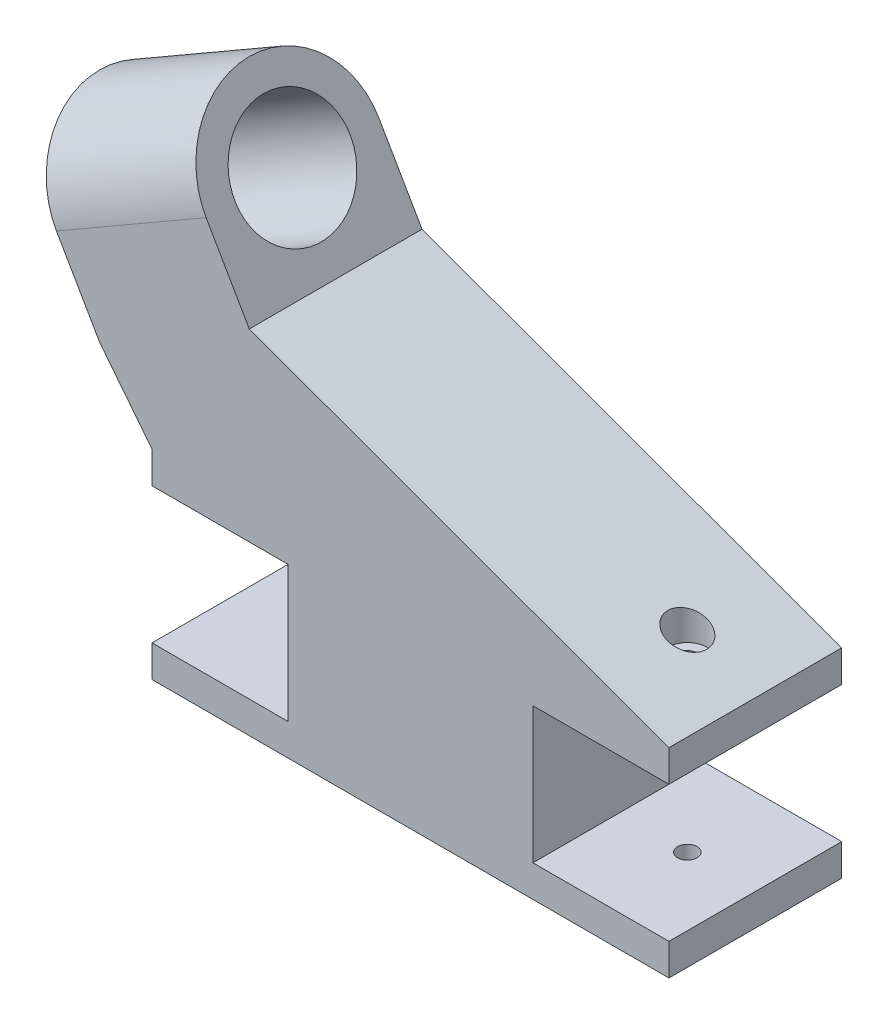
ISO-10303-21;
HEADER;
FILE_DESCRIPTION(('STEP AP214'),'2;1');
FILE_NAME('part.step','',(''),(''),'','','');
FILE_SCHEMA(('AUTOMOTIVE_DESIGN { 1 0 10303 214 1 1 1 1 }'));
ENDSEC;
DATA;
#1=APPLICATION_CONTEXT('core data for automotive mechanical design processes');
#2=APPLICATION_PROTOCOL_DEFINITION('international standard','automotive_design',2000,#1);
#3=PRODUCT_CONTEXT('',#1,'mechanical');
#4=PRODUCT('Part','Part','',(#3));
#5=PRODUCT_RELATED_PRODUCT_CATEGORY('part','',(#4));
#6=PRODUCT_DEFINITION_FORMATION('','',#4);
#7=PRODUCT_DEFINITION_CONTEXT('part definition',#1,'design');
#8=PRODUCT_DEFINITION('design','',#6,#7);
#9=PRODUCT_DEFINITION_SHAPE('','',#8);
#10=(LENGTH_UNIT() NAMED_UNIT(*) SI_UNIT(.MILLI.,.METRE.));
#11=(NAMED_UNIT(*) PLANE_ANGLE_UNIT() SI_UNIT($,.RADIAN.));
#12=(NAMED_UNIT(*) SI_UNIT($,.STERADIAN.) SOLID_ANGLE_UNIT());
#13=UNCERTAINTY_MEASURE_WITH_UNIT(LENGTH_MEASURE(1.E-05),#10,'distance_accuracy_value','');
#14=(GEOMETRIC_REPRESENTATION_CONTEXT(3) GLOBAL_UNCERTAINTY_ASSIGNED_CONTEXT((#13)) GLOBAL_UNIT_ASSIGNED_CONTEXT((#10,
#11,#12)) REPRESENTATION_CONTEXT('',''));
#15=CARTESIAN_POINT('',(0.,0.,0.));
#16=DIRECTION('',(0.,0.,1.));
#17=DIRECTION('',(1.,0.,0.));
#18=AXIS2_PLACEMENT_3D('',#15,#16,#17);
#19=CARTESIAN_POINT('',(-87.5933518262805,47.6249999999999,38.1));
#20=DIRECTION('',(0.866025403784438,0.500000000000001,0.));
#21=DIRECTION('',(-0.500000000000001,0.866025403784438,0.));
#22=AXIS2_PLACEMENT_3D('',#19,#20,#21);
#23=PLANE('',#22);
#24=CARTESIAN_POINT('',(-78.0683518262805,31.1272160579064,19.05));
#25=DIRECTION('',(0.866025403784438,0.500000000000001,0.));
#26=DIRECTION('',(-0.500000000000001,0.866025403784438,0.));
#27=AXIS2_PLACEMENT_3D('',#24,#25,#26);
#28=CIRCLE('',#27,12.7);
#29=CARTESIAN_POINT('',(-84.4183518262805,42.1257386859688,19.05));
#30=VERTEX_POINT('',#29);
#31=EDGE_CURVE('E354',#30,#30,#28,.T.);
#32=ORIENTED_EDGE('',*,*,#31,.T.);
#33=EDGE_LOOP('',(#32));
#34=FACE_BOUND('',#33,.T.);
#35=CARTESIAN_POINT('',(-78.0683518262805,31.1272160579064,19.05));
#36=DIRECTION('',(0.866025403784438,0.500000000000001,0.));
#37=DIRECTION('',(-0.500000000000001,0.866025403784438,0.));
#38=AXIS2_PLACEMENT_3D('',#35,#36,#37);
#39=CIRCLE('',#38,19.05);
#40=CARTESIAN_POINT('',(-78.0683518262805,31.1272160579064,38.1));
#41=VERTEX_POINT('',#40);
#42=CARTESIAN_POINT('',(-78.0683518262805,31.1272160579064,0.));
#43=VERTEX_POINT('',#42);
#44=EDGE_CURVE('E62',#41,#43,#39,.F.);
#45=ORIENTED_EDGE('',*,*,#44,.T.);
#46=DIRECTION('',(0.500000000000001,-0.866025403784438,0.));
#47=VECTOR('',#46,1.);
#48=CARTESIAN_POINT('',(-87.5933518262805,47.6249999999999,0.));
#49=LINE('',#48,#47);
#50=CARTESIAN_POINT('',(-68.5433518262805,14.6294321158129,0.));
#51=VERTEX_POINT('',#50);
#52=EDGE_CURVE('E204',#43,#51,#49,.T.);
#53=ORIENTED_EDGE('',*,*,#52,.T.);
#54=DIRECTION('',(0.,0.,-1.));
#55=VECTOR('',#54,1.);
#56=CARTESIAN_POINT('',(-68.5433518262805,14.6294321158129,38.1));
#57=LINE('',#56,#55);
#58=CARTESIAN_POINT('',(-68.5433518262805,14.6294321158129,38.1));
#59=VERTEX_POINT('',#58);
#60=EDGE_CURVE('E290',#59,#51,#57,.T.);
#61=ORIENTED_EDGE('',*,*,#60,.F.);
#62=DIRECTION('',(0.500000000000001,-0.866025403784438,0.));
#63=VECTOR('',#62,1.);
#64=CARTESIAN_POINT('',(-87.5933518262805,47.6249999999999,38.1));
#65=LINE('',#64,#63);
#66=EDGE_CURVE('E131',#41,#59,#65,.T.);
#67=ORIENTED_EDGE('',*,*,#66,.F.);
#68=EDGE_LOOP('',(#45,#53,#61,#67));
#69=FACE_BOUND('',#68,.T.);
#70=ADVANCED_FACE('F47',(#34,#69),#23,.F.);
#71=CARTESIAN_POINT('',(-54.5977839420934,66.675,38.1));
#72=DIRECTION('',(0.866025403784438,0.500000000000001,0.));
#73=DIRECTION('',(-0.500000000000001,0.866025403784438,0.));
#74=AXIS2_PLACEMENT_3D('',#71,#72,#73);
#75=PLANE('',#74);
#76=CARTESIAN_POINT('',(-45.0727839420934,50.1772160579064,19.05));
#77=DIRECTION('',(0.866025403784438,0.500000000000001,0.));
#78=DIRECTION('',(-0.500000000000001,0.866025403784438,0.));
#79=AXIS2_PLACEMENT_3D('',#76,#77,#78);
#80=CIRCLE('',#79,12.7);
#81=CARTESIAN_POINT('',(-51.4227839420934,61.1757386859688,19.05));
#82=VERTEX_POINT('',#81);
#83=EDGE_CURVE('E412',#82,#82,#80,.T.);
#84=ORIENTED_EDGE('',*,*,#83,.F.);
#85=EDGE_LOOP('',(#84));
#86=FACE_BOUND('',#85,.T.);
#87=DIRECTION('',(0.500000000000001,-0.866025403784438,0.));
#88=VECTOR('',#87,1.);
#89=CARTESIAN_POINT('',(-54.5977839420934,66.675,0.));
#90=LINE('',#89,#88);
#91=CARTESIAN_POINT('',(-45.0727839420934,50.1772160579064,0.));
#92=VERTEX_POINT('',#91);
#93=CARTESIAN_POINT('',(-35.5477839420934,33.6794321158129,0.));
#94=VERTEX_POINT('',#93);
#95=EDGE_CURVE('E124',#92,#94,#90,.T.);
#96=ORIENTED_EDGE('',*,*,#95,.F.);
#97=CARTESIAN_POINT('',(-45.0727839420934,50.1772160579064,19.05));
#98=DIRECTION('',(0.866025403784438,0.500000000000001,0.));
#99=DIRECTION('',(-0.500000000000001,0.866025403784438,0.));
#100=AXIS2_PLACEMENT_3D('',#97,#98,#99);
#101=CIRCLE('',#100,19.05);
#102=CARTESIAN_POINT('',(-45.0727839420934,50.1772160579064,38.1));
#103=VERTEX_POINT('',#102);
#104=EDGE_CURVE('E349',#103,#92,#101,.F.);
#105=ORIENTED_EDGE('',*,*,#104,.F.);
#106=DIRECTION('',(0.500000000000001,-0.866025403784438,0.));
#107=VECTOR('',#106,1.);
#108=CARTESIAN_POINT('',(-54.5977839420934,66.675,38.1));
#109=LINE('',#108,#107);
#110=CARTESIAN_POINT('',(-35.5477839420934,33.6794321158129,38.1));
#111=VERTEX_POINT('',#110);
#112=EDGE_CURVE('E71',#103,#111,#109,.T.);
#113=ORIENTED_EDGE('',*,*,#112,.T.);
#114=DIRECTION('',(0.,0.,-1.));
#115=VECTOR('',#114,1.);
#116=CARTESIAN_POINT('',(-35.5477839420934,33.6794321158129,38.1));
#117=LINE('',#116,#115);
#118=EDGE_CURVE('E203',#111,#94,#117,.T.);
#119=ORIENTED_EDGE('',*,*,#118,.T.);
#120=EDGE_LOOP('',(#96,#105,#113,#119));
#121=FACE_BOUND('',#120,.T.);
#122=ADVANCED_FACE('F347',(#86,#121),#75,.T.);
#123=CARTESIAN_POINT('',(0.,0.,0.));
#124=DIRECTION('',(0.,0.,1.));
#125=DIRECTION('',(1.,0.,0.));
#126=AXIS2_PLACEMENT_3D('',#123,#124,#125);
#127=PLANE('',#126);
#128=DIRECTION('',(0.866025403784438,0.500000000000001,0.));
#129=VECTOR('',#128,1.);
#130=CARTESIAN_POINT('',(-117.743140586926,8.22096608690626,0.));
#131=LINE('',#130,#129);
#132=EDGE_CURVE('E11',#92,#43,#131,.F.);
#133=ORIENTED_EDGE('',*,*,#132,.F.);
#134=ORIENTED_EDGE('',*,*,#95,.T.);
#135=DIRECTION('',(0.939709610175946,-0.341973461752474,0.));
#136=VECTOR('',#135,1.);
#137=CARTESIAN_POINT('',(-35.5477839420934,33.6794321158129,0.));
#138=LINE('',#137,#136);
#139=CARTESIAN_POINT('',(56.999999919,-1.09287578986539E-13,0.));
#140=VERTEX_POINT('',#139);
#141=EDGE_CURVE('E252',#94,#140,#138,.T.);
#142=ORIENTED_EDGE('',*,*,#141,.T.);
#143=DIRECTION('',(0.,-1.,0.));
#144=VECTOR('',#143,1.);
#145=CARTESIAN_POINT('',(56.999999919,-1.09287578986539E-13,0.));
#146=LINE('',#145,#144);
#147=CARTESIAN_POINT('',(56.999999919,-6.99999997000011,0.));
#148=VERTEX_POINT('',#147);
#149=EDGE_CURVE('E249',#140,#148,#146,.T.);
#150=ORIENTED_EDGE('',*,*,#149,.T.);
#151=DIRECTION('',(-1.,0.,0.));
#152=VECTOR('',#151,1.);
#153=CARTESIAN_POINT('',(56.999999919,-6.99999997000011,0.));
#154=LINE('',#153,#152);
#155=CARTESIAN_POINT('',(26.999999975,-6.99999997000008,0.));
#156=VERTEX_POINT('',#155);
#157=EDGE_CURVE('E173',#148,#156,#154,.T.);
#158=ORIENTED_EDGE('',*,*,#157,.T.);
#159=DIRECTION('',(0.,-1.,0.));
#160=VECTOR('',#159,1.);
#161=CARTESIAN_POINT('',(26.999999975,-6.99999997000008,0.));
#162=LINE('',#161,#160);
#163=CARTESIAN_POINT('',(26.999999975,-36.9999999140001,0.));
#164=VERTEX_POINT('',#163);
#165=EDGE_CURVE('E243',#156,#164,#162,.T.);
#166=ORIENTED_EDGE('',*,*,#165,.T.);
#167=DIRECTION('',(1.,0.,0.));
#168=VECTOR('',#167,1.);
#169=CARTESIAN_POINT('',(26.999999975,-36.9999999140001,0.));
#170=LINE('',#169,#168);
#171=CARTESIAN_POINT('',(56.999999919,-36.9999999140001,0.));
#172=VERTEX_POINT('',#171);
#173=EDGE_CURVE('E239',#164,#172,#170,.T.);
#174=ORIENTED_EDGE('',*,*,#173,.T.);
#175=DIRECTION('',(0.,-1.,0.));
#176=VECTOR('',#175,1.);
#177=CARTESIAN_POINT('',(56.999999919,-36.9999999140001,0.));
#178=LINE('',#177,#176);
#179=CARTESIAN_POINT('',(56.999999919,-43.9999998840001,0.));
#180=VERTEX_POINT('',#179);
#181=EDGE_CURVE('E235',#172,#180,#178,.T.);
#182=ORIENTED_EDGE('',*,*,#181,.T.);
#183=DIRECTION('',(-1.,0.,0.));
#184=VECTOR('',#183,1.);
#185=CARTESIAN_POINT('',(56.999999919,-43.9999998840001,0.));
#186=LINE('',#185,#184);
#187=CARTESIAN_POINT('',(-56.999999919,-43.9999998840001,0.));
#188=VERTEX_POINT('',#187);
#189=EDGE_CURVE('E231',#180,#188,#186,.T.);
#190=ORIENTED_EDGE('',*,*,#189,.T.);
#191=DIRECTION('',(0.,1.,0.));
#192=VECTOR('',#191,1.);
#193=CARTESIAN_POINT('',(-56.999999919,-43.9999998840001,0.));
#194=LINE('',#193,#192);
#195=CARTESIAN_POINT('',(-56.999999919,-36.9999999140001,0.));
#196=VERTEX_POINT('',#195);
#197=EDGE_CURVE('E227',#188,#196,#194,.T.);
#198=ORIENTED_EDGE('',*,*,#197,.T.);
#199=DIRECTION('',(1.,0.,0.));
#200=VECTOR('',#199,1.);
#201=CARTESIAN_POINT('',(-56.999999919,-36.9999999140001,0.));
#202=LINE('',#201,#200);
#203=CARTESIAN_POINT('',(-26.999999975,-36.9999999140001,0.));
#204=VERTEX_POINT('',#203);
#205=EDGE_CURVE('E223',#196,#204,#202,.T.);
#206=ORIENTED_EDGE('',*,*,#205,.T.);
#207=DIRECTION('',(0.,1.,0.));
#208=VECTOR('',#207,1.);
#209=CARTESIAN_POINT('',(-26.999999975,-36.9999999140001,0.));
#210=LINE('',#209,#208);
#211=CARTESIAN_POINT('',(-26.999999975,-6.9999999700001,0.));
#212=VERTEX_POINT('',#211);
#213=EDGE_CURVE('E219',#204,#212,#210,.T.);
#214=ORIENTED_EDGE('',*,*,#213,.T.);
#215=DIRECTION('',(-1.,0.,0.));
#216=VECTOR('',#215,1.);
#217=CARTESIAN_POINT('',(-26.999999975,-6.9999999700001,0.));
#218=LINE('',#217,#216);
#219=CARTESIAN_POINT('',(-56.999999919,-6.99999997000011,0.));
#220=VERTEX_POINT('',#219);
#221=EDGE_CURVE('E215',#212,#220,#218,.T.);
#222=ORIENTED_EDGE('',*,*,#221,.T.);
#223=DIRECTION('',(9.94244373635168E-13,1.,0.));
#224=VECTOR('',#223,1.);
#225=CARTESIAN_POINT('',(-56.999999919,-6.99999997000011,0.));
#226=LINE('',#225,#224);
#227=CARTESIAN_POINT('',(-56.999999918993,0.,0.));
#228=VERTEX_POINT('',#227);
#229=EDGE_CURVE('E211',#220,#228,#226,.T.);
#230=ORIENTED_EDGE('',*,*,#229,.T.);
#231=DIRECTION('',(-0.619439315760131,0.785044542743035,0.));
#232=VECTOR('',#231,1.);
#233=CARTESIAN_POINT('',(-56.999999918993,0.,0.));
#234=LINE('',#233,#232);
#235=EDGE_CURVE('E207',#228,#51,#234,.T.);
#236=ORIENTED_EDGE('',*,*,#235,.T.);
#237=ORIENTED_EDGE('',*,*,#52,.F.);
#238=EDGE_LOOP('',(#133,#134,#142,#150,#158,#166,#174,#182,#190,#198,#206,#214,#222,#230,#236,#237));
#239=FACE_BOUND('',#238,.T.);
#240=ADVANCED_FACE('F343',(#239),#127,.F.);
#241=CARTESIAN_POINT('',(0.,0.,38.1));
#242=DIRECTION('',(0.,0.,1.));
#243=DIRECTION('',(1.,0.,0.));
#244=AXIS2_PLACEMENT_3D('',#241,#242,#243);
#245=PLANE('',#244);
#246=ORIENTED_EDGE('',*,*,#112,.F.);
#247=DIRECTION('',(0.866025403784438,0.500000000000001,0.));
#248=VECTOR('',#247,1.);
#249=CARTESIAN_POINT('',(-117.743140586926,8.22096608690626,38.1));
#250=LINE('',#249,#248);
#251=EDGE_CURVE('E56',#103,#41,#250,.F.);
#252=ORIENTED_EDGE('',*,*,#251,.T.);
#253=ORIENTED_EDGE('',*,*,#66,.T.);
#254=DIRECTION('',(-0.619439315760131,0.785044542743035,0.));
#255=VECTOR('',#254,1.);
#256=CARTESIAN_POINT('',(-56.999999918993,0.,38.1));
#257=LINE('',#256,#255);
#258=CARTESIAN_POINT('',(-56.999999918993,0.,38.1));
#259=VERTEX_POINT('',#258);
#260=EDGE_CURVE('E300',#259,#59,#257,.T.);
#261=ORIENTED_EDGE('',*,*,#260,.F.);
#262=DIRECTION('',(9.94244373635168E-13,1.,0.));
#263=VECTOR('',#262,1.);
#264=CARTESIAN_POINT('',(-56.999999919,-6.99999997000011,38.1));
#265=LINE('',#264,#263);
#266=CARTESIAN_POINT('',(-56.999999919,-6.99999997000011,38.1));
#267=VERTEX_POINT('',#266);
#268=EDGE_CURVE('E303',#267,#259,#265,.T.);
#269=ORIENTED_EDGE('',*,*,#268,.F.);
#270=DIRECTION('',(-1.,0.,0.));
#271=VECTOR('',#270,1.);
#272=CARTESIAN_POINT('',(-26.999999975,-6.9999999700001,38.1));
#273=LINE('',#272,#271);
#274=CARTESIAN_POINT('',(-26.999999975,-6.9999999700001,38.1));
#275=VERTEX_POINT('',#274);
#276=EDGE_CURVE('E311',#275,#267,#273,.T.);
#277=ORIENTED_EDGE('',*,*,#276,.F.);
#278=DIRECTION('',(0.,1.,0.));
#279=VECTOR('',#278,1.);
#280=CARTESIAN_POINT('',(-26.999999975,-36.9999999140001,38.1));
#281=LINE('',#280,#279);
#282=CARTESIAN_POINT('',(-26.999999975,-36.9999999140001,38.1));
#283=VERTEX_POINT('',#282);
#284=EDGE_CURVE('E315',#283,#275,#281,.T.);
#285=ORIENTED_EDGE('',*,*,#284,.F.);
#286=DIRECTION('',(1.,0.,0.));
#287=VECTOR('',#286,1.);
#288=CARTESIAN_POINT('',(-56.999999919,-36.9999999140001,38.1));
#289=LINE('',#288,#287);
#290=CARTESIAN_POINT('',(-56.999999919,-36.9999999140001,38.1));
#291=VERTEX_POINT('',#290);
#292=EDGE_CURVE('E319',#291,#283,#289,.T.);
#293=ORIENTED_EDGE('',*,*,#292,.F.);
#294=DIRECTION('',(0.,1.,0.));
#295=VECTOR('',#294,1.);
#296=CARTESIAN_POINT('',(-56.999999919,-43.9999998840001,38.1));
#297=LINE('',#296,#295);
#298=CARTESIAN_POINT('',(-56.999999919,-43.9999998840001,38.1));
#299=VERTEX_POINT('',#298);
#300=EDGE_CURVE('E323',#299,#291,#297,.T.);
#301=ORIENTED_EDGE('',*,*,#300,.F.);
#302=DIRECTION('',(-1.,0.,0.));
#303=VECTOR('',#302,1.);
#304=CARTESIAN_POINT('',(56.999999919,-43.9999998840001,38.1));
#305=LINE('',#304,#303);
#306=CARTESIAN_POINT('',(56.999999919,-43.9999998840001,38.1));
#307=VERTEX_POINT('',#306);
#308=EDGE_CURVE('E327',#307,#299,#305,.T.);
#309=ORIENTED_EDGE('',*,*,#308,.F.);
#310=DIRECTION('',(0.,-1.,0.));
#311=VECTOR('',#310,1.);
#312=CARTESIAN_POINT('',(56.999999919,-36.9999999140001,38.1));
#313=LINE('',#312,#311);
#314=CARTESIAN_POINT('',(56.999999919,-36.9999999140001,38.1));
#315=VERTEX_POINT('',#314);
#316=EDGE_CURVE('E331',#315,#307,#313,.T.);
#317=ORIENTED_EDGE('',*,*,#316,.F.);
#318=DIRECTION('',(1.,0.,0.));
#319=VECTOR('',#318,1.);
#320=CARTESIAN_POINT('',(26.999999975,-36.9999999140001,38.1));
#321=LINE('',#320,#319);
#322=CARTESIAN_POINT('',(26.999999975,-36.9999999140001,38.1));
#323=VERTEX_POINT('',#322);
#324=EDGE_CURVE('E335',#323,#315,#321,.T.);
#325=ORIENTED_EDGE('',*,*,#324,.F.);
#326=DIRECTION('',(0.,-1.,0.));
#327=VECTOR('',#326,1.);
#328=CARTESIAN_POINT('',(26.999999975,-6.99999997000008,38.1));
#329=LINE('',#328,#327);
#330=CARTESIAN_POINT('',(26.999999975,-6.99999997000008,38.1));
#331=VERTEX_POINT('',#330);
#332=EDGE_CURVE('E190',#331,#323,#329,.T.);
#333=ORIENTED_EDGE('',*,*,#332,.F.);
#334=DIRECTION('',(-1.,0.,0.));
#335=VECTOR('',#334,1.);
#336=CARTESIAN_POINT('',(56.999999919,-6.99999997000011,38.1));
#337=LINE('',#336,#335);
#338=CARTESIAN_POINT('',(56.999999919,-6.99999997000011,38.1));
#339=VERTEX_POINT('',#338);
#340=EDGE_CURVE('E171',#339,#331,#337,.T.);
#341=ORIENTED_EDGE('',*,*,#340,.F.);
#342=DIRECTION('',(0.,-1.,0.));
#343=VECTOR('',#342,1.);
#344=CARTESIAN_POINT('',(56.999999919,-1.09287578986539E-13,38.1));
#345=LINE('',#344,#343);
#346=CARTESIAN_POINT('',(56.999999919,-1.09287578986539E-13,38.1));
#347=VERTEX_POINT('',#346);
#348=EDGE_CURVE('E186',#347,#339,#345,.T.);
#349=ORIENTED_EDGE('',*,*,#348,.F.);
#350=DIRECTION('',(0.939709610175946,-0.341973461752474,0.));
#351=VECTOR('',#350,1.);
#352=CARTESIAN_POINT('',(-35.5477839420934,33.6794321158129,38.1));
#353=LINE('',#352,#351);
#354=EDGE_CURVE('E195',#111,#347,#353,.T.);
#355=ORIENTED_EDGE('',*,*,#354,.F.);
#356=EDGE_LOOP('',(#246,#252,#253,#261,#269,#277,#285,#293,#301,#309,#317,#325,#333,#341,#349,#355));
#357=FACE_BOUND('',#356,.T.);
#358=ADVANCED_FACE('F184',(#357),#245,.T.);
#359=CARTESIAN_POINT('',(-56.999999918993,0.,38.1));
#360=DIRECTION('',(-0.785044542743035,-0.619439315760131,0.));
#361=DIRECTION('',(0.619439315760131,-0.785044542743035,0.));
#362=AXIS2_PLACEMENT_3D('',#359,#360,#361);
#363=PLANE('',#362);
#364=ORIENTED_EDGE('',*,*,#235,.F.);
#365=DIRECTION('',(0.,0.,-1.));
#366=VECTOR('',#365,1.);
#367=CARTESIAN_POINT('',(-56.999999918993,0.,38.1));
#368=LINE('',#367,#366);
#369=EDGE_CURVE('E287',#259,#228,#368,.T.);
#370=ORIENTED_EDGE('',*,*,#369,.F.);
#371=ORIENTED_EDGE('',*,*,#260,.T.);
#372=ORIENTED_EDGE('',*,*,#60,.T.);
#373=EDGE_LOOP('',(#364,#370,#371,#372));
#374=FACE_BOUND('',#373,.T.);
#375=ADVANCED_FACE('F357',(#374),#363,.T.);
#376=CARTESIAN_POINT('',(-56.999999919,-6.99999997000011,38.1));
#377=DIRECTION('',(-1.,9.94244373635168E-13,0.));
#378=DIRECTION('',(-9.94244373635168E-13,-1.,0.));
#379=AXIS2_PLACEMENT_3D('',#376,#377,#378);
#380=PLANE('',#379);
#381=ORIENTED_EDGE('',*,*,#229,.F.);
#382=DIRECTION('',(0.,0.,-1.));
#383=VECTOR('',#382,1.);
#384=CARTESIAN_POINT('',(-56.999999919,-6.99999997000011,38.1));
#385=LINE('',#384,#383);
#386=EDGE_CURVE('E284',#267,#220,#385,.T.);
#387=ORIENTED_EDGE('',*,*,#386,.F.);
#388=ORIENTED_EDGE('',*,*,#268,.T.);
#389=ORIENTED_EDGE('',*,*,#369,.T.);
#390=EDGE_LOOP('',(#381,#387,#388,#389));
#391=FACE_BOUND('',#390,.T.);
#392=ADVANCED_FACE('F362',(#391),#380,.T.);
#393=CARTESIAN_POINT('',(-26.999999975,-6.9999999700001,38.1));
#394=DIRECTION('',(0.,-1.,0.));
#395=DIRECTION('',(1.,0.,0.));
#396=AXIS2_PLACEMENT_3D('',#393,#394,#395);
#397=PLANE('',#396);
#398=ORIENTED_EDGE('',*,*,#221,.F.);
#399=DIRECTION('',(0.,0.,-1.));
#400=VECTOR('',#399,1.);
#401=CARTESIAN_POINT('',(-26.999999975,-6.9999999700001,38.1));
#402=LINE('',#401,#400);
#403=EDGE_CURVE('E281',#275,#212,#402,.T.);
#404=ORIENTED_EDGE('',*,*,#403,.F.);
#405=ORIENTED_EDGE('',*,*,#276,.T.);
#406=ORIENTED_EDGE('',*,*,#386,.T.);
#407=EDGE_LOOP('',(#398,#404,#405,#406));
#408=FACE_BOUND('',#407,.T.);
#409=ADVANCED_FACE('F365',(#408),#397,.T.);
#410=CARTESIAN_POINT('',(-26.999999975,-36.9999999140001,38.1));
#411=DIRECTION('',(-1.,0.,0.));
#412=DIRECTION('',(0.,-1.,0.));
#413=AXIS2_PLACEMENT_3D('',#410,#411,#412);
#414=PLANE('',#413);
#415=ORIENTED_EDGE('',*,*,#213,.F.);
#416=DIRECTION('',(0.,0.,-1.));
#417=VECTOR('',#416,1.);
#418=CARTESIAN_POINT('',(-26.999999975,-36.9999999140001,38.1));
#419=LINE('',#418,#417);
#420=EDGE_CURVE('E278',#283,#204,#419,.T.);
#421=ORIENTED_EDGE('',*,*,#420,.F.);
#422=ORIENTED_EDGE('',*,*,#284,.T.);
#423=ORIENTED_EDGE('',*,*,#403,.T.);
#424=EDGE_LOOP('',(#415,#421,#422,#423));
#425=FACE_BOUND('',#424,.T.);
#426=ADVANCED_FACE('F370',(#425),#414,.T.);
#427=CARTESIAN_POINT('',(-56.999999919,-36.9999999140001,38.1));
#428=DIRECTION('',(0.,1.,0.));
#429=DIRECTION('',(0.,0.,1.));
#430=AXIS2_PLACEMENT_3D('',#427,#428,#429);
#431=PLANE('',#430);
#432=CARTESIAN_POINT('',(-41.999999947,-36.9999999140001,19.05));
#433=DIRECTION('',(0.,1.,0.));
#434=DIRECTION('',(0.,0.,1.));
#435=AXIS2_PLACEMENT_3D('',#432,#433,#434);
#436=CIRCLE('',#435,2.15000001800001);
#437=CARTESIAN_POINT('',(-41.999999947,-36.9999999140001,21.200000018));
#438=VERTEX_POINT('',#437);
#439=EDGE_CURVE('E416',#438,#438,#436,.T.);
#440=ORIENTED_EDGE('',*,*,#439,.F.);
#441=EDGE_LOOP('',(#440));
#442=FACE_BOUND('',#441,.T.);
#443=ORIENTED_EDGE('',*,*,#205,.F.);
#444=DIRECTION('',(0.,0.,-1.));
#445=VECTOR('',#444,1.);
#446=CARTESIAN_POINT('',(-56.999999919,-36.9999999140001,38.1));
#447=LINE('',#446,#445);
#448=EDGE_CURVE('E275',#291,#196,#447,.T.);
#449=ORIENTED_EDGE('',*,*,#448,.F.);
#450=ORIENTED_EDGE('',*,*,#292,.T.);
#451=ORIENTED_EDGE('',*,*,#420,.T.);
#452=EDGE_LOOP('',(#443,#449,#450,#451));
#453=FACE_BOUND('',#452,.T.);
#454=ADVANCED_FACE('F373',(#442,#453),#431,.T.);
#455=CARTESIAN_POINT('',(-56.999999919,-43.9999998840001,38.1));
#456=DIRECTION('',(-1.,0.,0.));
#457=DIRECTION('',(0.,0.,1.));
#458=AXIS2_PLACEMENT_3D('',#455,#456,#457);
#459=PLANE('',#458);
#460=ORIENTED_EDGE('',*,*,#197,.F.);
#461=DIRECTION('',(0.,0.,-1.));
#462=VECTOR('',#461,1.);
#463=CARTESIAN_POINT('',(-56.999999919,-43.9999998840001,38.1));
#464=LINE('',#463,#462);
#465=EDGE_CURVE('E272',#299,#188,#464,.T.);
#466=ORIENTED_EDGE('',*,*,#465,.F.);
#467=ORIENTED_EDGE('',*,*,#300,.T.);
#468=ORIENTED_EDGE('',*,*,#448,.T.);
#469=EDGE_LOOP('',(#460,#466,#467,#468));
#470=FACE_BOUND('',#469,.T.);
#471=ADVANCED_FACE('F378',(#470),#459,.T.);
#472=CARTESIAN_POINT('',(56.999999919,-43.9999998840001,38.1));
#473=DIRECTION('',(0.,-1.,0.));
#474=DIRECTION('',(0.,0.,-1.));
#475=AXIS2_PLACEMENT_3D('',#472,#473,#474);
#476=PLANE('',#475);
#477=CARTESIAN_POINT('',(41.999999947,-43.9999998840001,19.05));
#478=DIRECTION('',(0.,-1.,0.));
#479=DIRECTION('',(0.,0.,-1.));
#480=AXIS2_PLACEMENT_3D('',#477,#478,#479);
#481=CIRCLE('',#480,2.15000001800001);
#482=CARTESIAN_POINT('',(41.999999947,-43.9999998840001,16.899999982));
#483=VERTEX_POINT('',#482);
#484=EDGE_CURVE('E430',#483,#483,#481,.T.);
#485=ORIENTED_EDGE('',*,*,#484,.F.);
#486=EDGE_LOOP('',(#485));
#487=FACE_BOUND('',#486,.T.);
#488=CARTESIAN_POINT('',(-41.999999947,-43.9999998840001,19.05));
#489=DIRECTION('',(0.,-1.,0.));
#490=DIRECTION('',(0.,0.,-1.));
#491=AXIS2_PLACEMENT_3D('',#488,#489,#490);
#492=CIRCLE('',#491,2.15000001800001);
#493=CARTESIAN_POINT('',(-41.999999947,-43.9999998840001,16.899999982));
#494=VERTEX_POINT('',#493);
#495=EDGE_CURVE('E422',#494,#494,#492,.T.);
#496=ORIENTED_EDGE('',*,*,#495,.F.);
#497=EDGE_LOOP('',(#496));
#498=FACE_BOUND('',#497,.T.);
#499=ORIENTED_EDGE('',*,*,#189,.F.);
#500=DIRECTION('',(0.,0.,-1.));
#501=VECTOR('',#500,1.);
#502=CARTESIAN_POINT('',(56.999999919,-43.9999998840001,38.1));
#503=LINE('',#502,#501);
#504=EDGE_CURVE('E269',#307,#180,#503,.T.);
#505=ORIENTED_EDGE('',*,*,#504,.F.);
#506=ORIENTED_EDGE('',*,*,#308,.T.);
#507=ORIENTED_EDGE('',*,*,#465,.T.);
#508=EDGE_LOOP('',(#499,#505,#506,#507));
#509=FACE_BOUND('',#508,.T.);
#510=ADVANCED_FACE('F381',(#487,#498,#509),#476,.T.);
#511=CARTESIAN_POINT('',(56.999999919,-36.9999999140001,38.1));
#512=DIRECTION('',(1.,0.,0.));
#513=DIRECTION('',(0.,0.,-1.));
#514=AXIS2_PLACEMENT_3D('',#511,#512,#513);
#515=PLANE('',#514);
#516=ORIENTED_EDGE('',*,*,#181,.F.);
#517=DIRECTION('',(0.,0.,-1.));
#518=VECTOR('',#517,1.);
#519=CARTESIAN_POINT('',(56.999999919,-36.9999999140001,38.1));
#520=LINE('',#519,#518);
#521=EDGE_CURVE('E266',#315,#172,#520,.T.);
#522=ORIENTED_EDGE('',*,*,#521,.F.);
#523=ORIENTED_EDGE('',*,*,#316,.T.);
#524=ORIENTED_EDGE('',*,*,#504,.T.);
#525=EDGE_LOOP('',(#516,#522,#523,#524));
#526=FACE_BOUND('',#525,.T.);
#527=ADVANCED_FACE('F385',(#526),#515,.T.);
#528=CARTESIAN_POINT('',(26.999999975,-36.9999999140001,38.1));
#529=DIRECTION('',(0.,1.,0.));
#530=DIRECTION('',(0.,0.,1.));
#531=AXIS2_PLACEMENT_3D('',#528,#529,#530);
#532=PLANE('',#531);
#533=CARTESIAN_POINT('',(41.999999947,-36.9999999140001,19.05));
#534=DIRECTION('',(0.,1.,0.));
#535=DIRECTION('',(0.,0.,1.));
#536=AXIS2_PLACEMENT_3D('',#533,#534,#535);
#537=CIRCLE('',#536,2.15000001800001);
#538=CARTESIAN_POINT('',(41.999999947,-36.9999999140001,21.200000018));
#539=VERTEX_POINT('',#538);
#540=EDGE_CURVE('E426',#539,#539,#537,.T.);
#541=ORIENTED_EDGE('',*,*,#540,.F.);
#542=EDGE_LOOP('',(#541));
#543=FACE_BOUND('',#542,.T.);
#544=ORIENTED_EDGE('',*,*,#173,.F.);
#545=DIRECTION('',(0.,0.,-1.));
#546=VECTOR('',#545,1.);
#547=CARTESIAN_POINT('',(26.999999975,-36.9999999140001,38.1));
#548=LINE('',#547,#546);
#549=EDGE_CURVE('E263',#323,#164,#548,.T.);
#550=ORIENTED_EDGE('',*,*,#549,.F.);
#551=ORIENTED_EDGE('',*,*,#324,.T.);
#552=ORIENTED_EDGE('',*,*,#521,.T.);
#553=EDGE_LOOP('',(#544,#550,#551,#552));
#554=FACE_BOUND('',#553,.T.);
#555=ADVANCED_FACE('F387',(#543,#554),#532,.T.);
#556=CARTESIAN_POINT('',(26.999999975,-6.99999997000008,38.1));
#557=DIRECTION('',(1.,0.,0.));
#558=DIRECTION('',(0.,1.,0.));
#559=AXIS2_PLACEMENT_3D('',#556,#557,#558);
#560=PLANE('',#559);
#561=ORIENTED_EDGE('',*,*,#165,.F.);
#562=DIRECTION('',(0.,0.,-1.));
#563=VECTOR('',#562,1.);
#564=CARTESIAN_POINT('',(26.999999975,-6.99999997000008,38.1));
#565=LINE('',#564,#563);
#566=EDGE_CURVE('E179',#331,#156,#565,.T.);
#567=ORIENTED_EDGE('',*,*,#566,.F.);
#568=ORIENTED_EDGE('',*,*,#332,.T.);
#569=ORIENTED_EDGE('',*,*,#549,.T.);
#570=EDGE_LOOP('',(#561,#567,#568,#569));
#571=FACE_BOUND('',#570,.T.);
#572=ADVANCED_FACE('F341',(#571),#560,.T.);
#573=CARTESIAN_POINT('',(56.999999919,-6.99999997000011,38.1));
#574=DIRECTION('',(0.,-1.,0.));
#575=DIRECTION('',(1.,0.,0.));
#576=AXIS2_PLACEMENT_3D('',#573,#574,#575);
#577=PLANE('',#576);
#578=CARTESIAN_POINT('',(41.999999947,-6.99999997000003,19.05));
#579=DIRECTION('',(0.,-1.,0.));
#580=DIRECTION('',(0.,0.,-1.));
#581=AXIS2_PLACEMENT_3D('',#578,#579,#580);
#582=CIRCLE('',#581,2.15000001800001);
#583=CARTESIAN_POINT('',(41.999999947,-6.99999997000003,16.899999982));
#584=VERTEX_POINT('',#583);
#585=EDGE_CURVE('E442',#584,#584,#582,.T.);
#586=ORIENTED_EDGE('',*,*,#585,.F.);
#587=EDGE_LOOP('',(#586));
#588=FACE_BOUND('',#587,.T.);
#589=ORIENTED_EDGE('',*,*,#157,.F.);
#590=DIRECTION('',(0.,0.,-1.));
#591=VECTOR('',#590,1.);
#592=CARTESIAN_POINT('',(56.999999919,-6.99999997000011,38.1));
#593=LINE('',#592,#591);
#594=EDGE_CURVE('E168',#339,#148,#593,.T.);
#595=ORIENTED_EDGE('',*,*,#594,.F.);
#596=ORIENTED_EDGE('',*,*,#340,.T.);
#597=ORIENTED_EDGE('',*,*,#566,.T.);
#598=EDGE_LOOP('',(#589,#595,#596,#597));
#599=FACE_BOUND('',#598,.T.);
#600=ADVANCED_FACE('F170',(#588,#599),#577,.T.);
#601=CARTESIAN_POINT('',(56.999999919,-1.09287578986539E-13,38.1));
#602=DIRECTION('',(1.,0.,0.));
#603=DIRECTION('',(0.,0.,-1.));
#604=AXIS2_PLACEMENT_3D('',#601,#602,#603);
#605=PLANE('',#604);
#606=ORIENTED_EDGE('',*,*,#149,.F.);
#607=DIRECTION('',(0.,0.,-1.));
#608=VECTOR('',#607,1.);
#609=CARTESIAN_POINT('',(56.999999919,-1.09287578986539E-13,38.1));
#610=LINE('',#609,#608);
#611=EDGE_CURVE('E180',#347,#140,#610,.T.);
#612=ORIENTED_EDGE('',*,*,#611,.F.);
#613=ORIENTED_EDGE('',*,*,#348,.T.);
#614=ORIENTED_EDGE('',*,*,#594,.T.);
#615=EDGE_LOOP('',(#606,#612,#613,#614));
#616=FACE_BOUND('',#615,.T.);
#617=ADVANCED_FACE('F193',(#616),#605,.T.);
#618=CARTESIAN_POINT('',(-35.5477839420934,33.6794321158129,38.1));
#619=DIRECTION('',(0.341973461752475,0.939709610175946,0.));
#620=DIRECTION('',(-0.939709610175946,0.341973461752475,0.));
#621=AXIS2_PLACEMENT_3D('',#618,#619,#620);
#622=PLANE('',#621);
#623=CARTESIAN_POINT('',(41.999999947,5.45870964941107,19.05));
#624=DIRECTION('',(0.341973461752475,0.939709610175946,0.));
#625=DIRECTION('',(0.939709610175946,-0.341973461752475,0.));
#626=AXIS2_PLACEMENT_3D('',#623,#624,#625);
#627=ELLIPSE('',#626,4.57588172924495,4.30000003600001);
#628=CARTESIAN_POINT('',(46.299999983,3.89387953389128,19.05));
#629=VERTEX_POINT('',#628);
#630=EDGE_CURVE('E50',#629,#629,#627,.T.);
#631=ORIENTED_EDGE('',*,*,#630,.F.);
#632=EDGE_LOOP('',(#631));
#633=FACE_BOUND('',#632,.T.);
#634=ORIENTED_EDGE('',*,*,#141,.F.);
#635=ORIENTED_EDGE('',*,*,#118,.F.);
#636=ORIENTED_EDGE('',*,*,#354,.T.);
#637=ORIENTED_EDGE('',*,*,#611,.T.);
#638=EDGE_LOOP('',(#634,#635,#636,#637));
#639=FACE_BOUND('',#638,.T.);
#640=ADVANCED_FACE('F346',(#633,#639),#622,.T.);
#641=CARTESIAN_POINT('',(-117.743140586926,8.22096608690626,19.05));
#642=DIRECTION('',(0.866025403784438,0.500000000000001,0.));
#643=DIRECTION('',(-0.500000000000001,0.866025403784438,0.));
#644=AXIS2_PLACEMENT_3D('',#641,#642,#643);
#645=CYLINDRICAL_SURFACE('',#644,19.05);
#646=ORIENTED_EDGE('',*,*,#251,.F.);
#647=ORIENTED_EDGE('',*,*,#104,.T.);
#648=ORIENTED_EDGE('',*,*,#132,.T.);
#649=ORIENTED_EDGE('',*,*,#44,.F.);
#650=EDGE_LOOP('',(#646,#647,#648,#649));
#651=FACE_BOUND('',#650,.T.);
#652=ADVANCED_FACE('F351',(#651),#645,.T.);
#653=CARTESIAN_POINT('',(-45.0727839420934,50.1772160579064,19.05));
#654=DIRECTION('',(0.866025403784438,0.500000000000001,0.));
#655=DIRECTION('',(-0.500000000000001,0.866025403784438,0.));
#656=AXIS2_PLACEMENT_3D('',#653,#654,#655);
#657=CYLINDRICAL_SURFACE('',#656,12.7);
#658=ORIENTED_EDGE('',*,*,#83,.T.);
#659=EDGE_LOOP('',(#658));
#660=FACE_BOUND('',#659,.T.);
#661=ORIENTED_EDGE('',*,*,#31,.F.);
#662=EDGE_LOOP('',(#661));
#663=FACE_BOUND('',#662,.T.);
#664=ADVANCED_FACE('F465',(#660,#663),#657,.F.);
#665=CARTESIAN_POINT('',(-41.999999947,-43.9999998840001,19.05));
#666=DIRECTION('',(0.,-1.,0.));
#667=DIRECTION('',(0.,0.,-1.));
#668=AXIS2_PLACEMENT_3D('',#665,#666,#667);
#669=CYLINDRICAL_SURFACE('',#668,2.15000001800001);
#670=ORIENTED_EDGE('',*,*,#495,.T.);
#671=EDGE_LOOP('',(#670));
#672=FACE_BOUND('',#671,.T.);
#673=ORIENTED_EDGE('',*,*,#439,.T.);
#674=EDGE_LOOP('',(#673));
#675=FACE_BOUND('',#674,.T.);
#676=ADVANCED_FACE('F468',(#672,#675),#669,.F.);
#677=CARTESIAN_POINT('',(41.999999947,-43.9999998840001,19.05));
#678=DIRECTION('',(0.,-1.,0.));
#679=DIRECTION('',(0.,0.,-1.));
#680=AXIS2_PLACEMENT_3D('',#677,#678,#679);
#681=CYLINDRICAL_SURFACE('',#680,2.15000001800001);
#682=ORIENTED_EDGE('',*,*,#484,.T.);
#683=EDGE_LOOP('',(#682));
#684=FACE_BOUND('',#683,.T.);
#685=ORIENTED_EDGE('',*,*,#540,.T.);
#686=EDGE_LOOP('',(#685));
#687=FACE_BOUND('',#686,.T.);
#688=ADVANCED_FACE('F471',(#684,#687),#681,.F.);
#689=CARTESIAN_POINT('',(41.999999947,-6.99999997000003,19.05));
#690=DIRECTION('',(0.,-1.,0.));
#691=DIRECTION('',(0.,0.,-1.));
#692=AXIS2_PLACEMENT_3D('',#689,#690,#691);
#693=CYLINDRICAL_SURFACE('',#692,4.30000003600001);
#694=ORIENTED_EDGE('',*,*,#630,.T.);
#695=EDGE_LOOP('',(#694));
#696=FACE_BOUND('',#695,.T.);
#697=CARTESIAN_POINT('',(41.999999947,0.,19.05));
#698=DIRECTION('',(0.,-1.,0.));
#699=DIRECTION('',(0.,0.,-1.));
#700=AXIS2_PLACEMENT_3D('',#697,#698,#699);
#701=CIRCLE('',#700,4.30000003600001);
#702=CARTESIAN_POINT('',(41.999999947,0.,14.749999964));
#703=VERTEX_POINT('',#702);
#704=EDGE_CURVE('E434',#703,#703,#701,.T.);
#705=ORIENTED_EDGE('',*,*,#704,.T.);
#706=EDGE_LOOP('',(#705));
#707=FACE_BOUND('',#706,.T.);
#708=ADVANCED_FACE('F474',(#696,#707),#693,.F.);
#709=CARTESIAN_POINT('',(46.299999983,0.,19.05));
#710=DIRECTION('',(0.,-1.,0.));
#711=DIRECTION('',(0.,0.,-1.));
#712=AXIS2_PLACEMENT_3D('',#709,#710,#711);
#713=PLANE('',#712);
#714=ORIENTED_EDGE('',*,*,#704,.F.);
#715=EDGE_LOOP('',(#714));
#716=FACE_BOUND('',#715,.T.);
#717=CARTESIAN_POINT('',(41.999999947,0.,19.05));
#718=DIRECTION('',(0.,-1.,0.));
#719=DIRECTION('',(0.,0.,-1.));
#720=AXIS2_PLACEMENT_3D('',#717,#718,#719);
#721=CIRCLE('',#720,2.15000001800001);
#722=CARTESIAN_POINT('',(41.999999947,0.,16.899999982));
#723=VERTEX_POINT('',#722);
#724=EDGE_CURVE('E438',#723,#723,#721,.T.);
#725=ORIENTED_EDGE('',*,*,#724,.T.);
#726=EDGE_LOOP('',(#725));
#727=FACE_BOUND('',#726,.T.);
#728=ADVANCED_FACE('F478',(#716,#727),#713,.F.);
#729=CARTESIAN_POINT('',(41.999999947,-6.99999997000003,19.05));
#730=DIRECTION('',(0.,-1.,0.));
#731=DIRECTION('',(0.,0.,-1.));
#732=AXIS2_PLACEMENT_3D('',#729,#730,#731);
#733=CYLINDRICAL_SURFACE('',#732,2.15000001800001);
#734=ORIENTED_EDGE('',*,*,#724,.F.);
#735=EDGE_LOOP('',(#734));
#736=FACE_BOUND('',#735,.T.);
#737=ORIENTED_EDGE('',*,*,#585,.T.);
#738=EDGE_LOOP('',(#737));
#739=FACE_BOUND('',#738,.T.);
#740=ADVANCED_FACE('F447',(#736,#739),#733,.F.);
#741=CLOSED_SHELL('',(#70,#122,#240,#358,#375,#392,#409,#426,#454,#471,#510,#527,#555,#572,#600,
#617,#640,#652,#664,#676,#688,#708,#728,#740));
#742=MANIFOLD_SOLID_BREP('B2',#741);
#743=ADVANCED_BREP_SHAPE_REPRESENTATION('',(#18,#742),#14);
#744=SHAPE_DEFINITION_REPRESENTATION(#9,#743);
ENDSEC;
END-ISO-10303-21;
